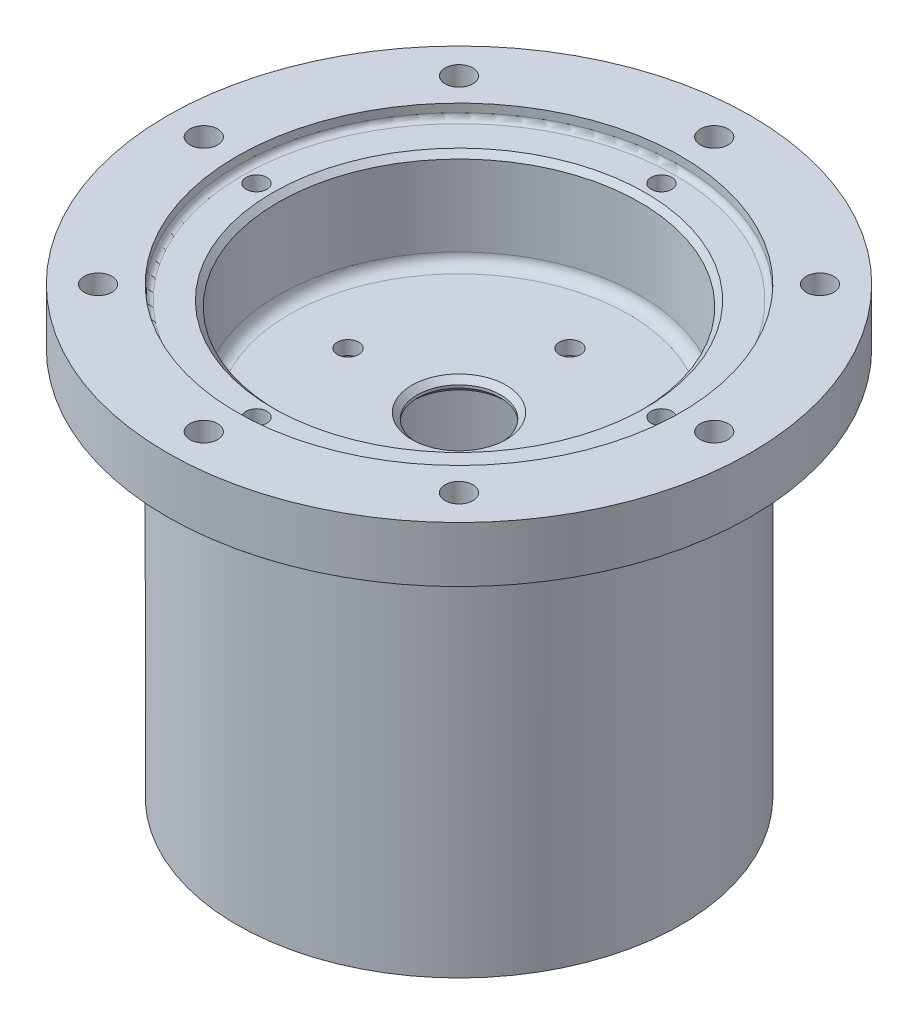
ISO-10303-21;
HEADER;
FILE_DESCRIPTION(('STEP AP214'),'2;1');
FILE_NAME('part.step','',(''),(''),'','','');
FILE_SCHEMA(('AUTOMOTIVE_DESIGN { 1 0 10303 214 1 1 1 1 }'));
ENDSEC;
DATA;
#1=APPLICATION_CONTEXT('core data for automotive mechanical design processes');
#2=APPLICATION_PROTOCOL_DEFINITION('international standard','automotive_design',2000,#1);
#3=PRODUCT_CONTEXT('',#1,'mechanical');
#4=PRODUCT('Part','Part','',(#3));
#5=PRODUCT_RELATED_PRODUCT_CATEGORY('part','',(#4));
#6=PRODUCT_DEFINITION_FORMATION('','',#4);
#7=PRODUCT_DEFINITION_CONTEXT('part definition',#1,'design');
#8=PRODUCT_DEFINITION('design','',#6,#7);
#9=PRODUCT_DEFINITION_SHAPE('','',#8);
#10=(LENGTH_UNIT() NAMED_UNIT(*) SI_UNIT(.MILLI.,.METRE.));
#11=(NAMED_UNIT(*) PLANE_ANGLE_UNIT() SI_UNIT($,.RADIAN.));
#12=(NAMED_UNIT(*) SI_UNIT($,.STERADIAN.) SOLID_ANGLE_UNIT());
#13=UNCERTAINTY_MEASURE_WITH_UNIT(LENGTH_MEASURE(1.E-05),#10,'distance_accuracy_value','');
#14=(GEOMETRIC_REPRESENTATION_CONTEXT(3) GLOBAL_UNCERTAINTY_ASSIGNED_CONTEXT((#13)) GLOBAL_UNIT_ASSIGNED_CONTEXT((#10,
#11,#12)) REPRESENTATION_CONTEXT('',''));
#15=CARTESIAN_POINT('',(0.,0.,0.));
#16=DIRECTION('',(0.,0.,1.));
#17=DIRECTION('',(1.,0.,0.));
#18=AXIS2_PLACEMENT_3D('',#15,#16,#17);
#19=CARTESIAN_POINT('',(-66.802,50.8,0.));
#20=DIRECTION('',(0.,1.,0.));
#21=DIRECTION('',(-1.,0.,0.));
#22=AXIS2_PLACEMENT_3D('',#19,#20,#21);
#23=PLANE('',#22);
#24=CARTESIAN_POINT('',(0.,50.8,-58.42));
#25=DIRECTION('',(0.,1.,0.));
#26=DIRECTION('',(0.,0.,1.));
#27=AXIS2_PLACEMENT_3D('',#24,#25,#26);
#28=CIRCLE('',#27,3.17499999999999);
#29=CARTESIAN_POINT('',(0.,50.8,-55.245));
#30=VERTEX_POINT('',#29);
#31=EDGE_CURVE('E563',#30,#30,#28,.T.);
#32=ORIENTED_EDGE('',*,*,#31,.F.);
#33=EDGE_LOOP('',(#32));
#34=FACE_BOUND('',#33,.T.);
#35=CARTESIAN_POINT('',(41.3091781569196,50.8,-41.3091781569217));
#36=DIRECTION('',(0.,1.,0.));
#37=DIRECTION('',(0.,0.,1.));
#38=AXIS2_PLACEMENT_3D('',#35,#36,#37);
#39=CIRCLE('',#38,3.17499999999999);
#40=CARTESIAN_POINT('',(41.3091781569196,50.8,-38.1341781569217));
#41=VERTEX_POINT('',#40);
#42=EDGE_CURVE('E565',#41,#41,#39,.T.);
#43=ORIENTED_EDGE('',*,*,#42,.F.);
#44=EDGE_LOOP('',(#43));
#45=FACE_BOUND('',#44,.T.);
#46=CARTESIAN_POINT('',(58.4200000000051,50.8,-5.13611453474389E-12));
#47=DIRECTION('',(0.,1.,0.));
#48=DIRECTION('',(0.,0.,1.));
#49=AXIS2_PLACEMENT_3D('',#46,#47,#48);
#50=CIRCLE('',#49,3.17499999999999);
#51=CARTESIAN_POINT('',(58.4200000000051,50.8,3.17499999999485));
#52=VERTEX_POINT('',#51);
#53=EDGE_CURVE('E573',#52,#52,#50,.T.);
#54=ORIENTED_EDGE('',*,*,#53,.F.);
#55=EDGE_LOOP('',(#54));
#56=FACE_BOUND('',#55,.T.);
#57=CARTESIAN_POINT('',(41.3091781569269,50.8,41.3091781569145));
#58=DIRECTION('',(0.,1.,0.));
#59=DIRECTION('',(0.,0.,1.));
#60=AXIS2_PLACEMENT_3D('',#57,#58,#59);
#61=CIRCLE('',#60,3.17499999999999);
#62=CARTESIAN_POINT('',(41.3091781569269,50.8,44.4841781569145));
#63=VERTEX_POINT('',#62);
#64=EDGE_CURVE('E579',#63,#63,#61,.T.);
#65=ORIENTED_EDGE('',*,*,#64,.F.);
#66=EDGE_LOOP('',(#65));
#67=FACE_BOUND('',#66,.T.);
#68=CARTESIAN_POINT('',(1.02566760551386E-11,50.8,58.42));
#69=DIRECTION('',(0.,1.,0.));
#70=DIRECTION('',(0.,0.,1.));
#71=AXIS2_PLACEMENT_3D('',#68,#69,#70);
#72=CIRCLE('',#71,3.17499999999999);
#73=CARTESIAN_POINT('',(1.02566760551386E-11,50.8,61.595));
#74=VERTEX_POINT('',#73);
#75=EDGE_CURVE('E585',#74,#74,#72,.T.);
#76=ORIENTED_EDGE('',*,*,#75,.F.);
#77=EDGE_LOOP('',(#76));
#78=FACE_BOUND('',#77,.T.);
#79=CARTESIAN_POINT('',(-41.3091781569093,50.8,41.3091781569217));
#80=DIRECTION('',(0.,1.,0.));
#81=DIRECTION('',(0.,0.,1.));
#82=AXIS2_PLACEMENT_3D('',#79,#80,#81);
#83=CIRCLE('',#82,3.17499999999999);
#84=CARTESIAN_POINT('',(-41.3091781569093,50.8,44.4841781569217));
#85=VERTEX_POINT('',#84);
#86=EDGE_CURVE('E591',#85,#85,#83,.T.);
#87=ORIENTED_EDGE('',*,*,#86,.F.);
#88=EDGE_LOOP('',(#87));
#89=FACE_BOUND('',#88,.T.);
#90=CARTESIAN_POINT('',(-58.4199999999949,50.8,5.14326892134451E-12));
#91=DIRECTION('',(0.,1.,0.));
#92=DIRECTION('',(0.,0.,1.));
#93=AXIS2_PLACEMENT_3D('',#90,#91,#92);
#94=CIRCLE('',#93,3.17499999999999);
#95=CARTESIAN_POINT('',(-58.4199999999949,50.8,3.17500000000513));
#96=VERTEX_POINT('',#95);
#97=EDGE_CURVE('E597',#96,#96,#94,.T.);
#98=ORIENTED_EDGE('',*,*,#97,.F.);
#99=EDGE_LOOP('',(#98));
#100=FACE_BOUND('',#99,.T.);
#101=CARTESIAN_POINT('',(-41.3091781569166,50.8,-41.3091781569145));
#102=DIRECTION('',(0.,1.,0.));
#103=DIRECTION('',(0.,0.,1.));
#104=AXIS2_PLACEMENT_3D('',#101,#102,#103);
#105=CIRCLE('',#104,3.17499999999999);
#106=CARTESIAN_POINT('',(-41.3091781569166,50.8,-38.1341781569145));
#107=VERTEX_POINT('',#106);
#108=EDGE_CURVE('E603',#107,#107,#105,.T.);
#109=ORIENTED_EDGE('',*,*,#108,.F.);
#110=EDGE_LOOP('',(#109));
#111=FACE_BOUND('',#110,.T.);
#112=CARTESIAN_POINT('',(0.,50.8,0.));
#113=DIRECTION('',(0.,1.,0.));
#114=DIRECTION('',(-1.,0.,0.));
#115=AXIS2_PLACEMENT_3D('',#112,#113,#114);
#116=CIRCLE('',#115,66.802);
#117=CARTESIAN_POINT('',(-66.802,50.8,0.));
#118=VERTEX_POINT('',#117);
#119=EDGE_CURVE('E109',#118,#118,#116,.T.);
#120=ORIENTED_EDGE('',*,*,#119,.T.);
#121=EDGE_LOOP('',(#120));
#122=FACE_BOUND('',#121,.T.);
#123=CARTESIAN_POINT('',(0.,50.8,0.));
#124=DIRECTION('',(0.,1.,0.));
#125=DIRECTION('',(-1.,0.,0.));
#126=AXIS2_PLACEMENT_3D('',#123,#124,#125);
#127=CIRCLE('',#126,50.8);
#128=CARTESIAN_POINT('',(-50.8,50.8,0.));
#129=VERTEX_POINT('',#128);
#130=EDGE_CURVE('E121',#129,#129,#127,.T.);
#131=ORIENTED_EDGE('',*,*,#130,.F.);
#132=EDGE_LOOP('',(#131));
#133=FACE_BOUND('',#132,.T.);
#134=ADVANCED_FACE('F33',(#34,#45,#56,#67,#78,#89,#100,#111,#122,#133),#23,.T.);
#135=CARTESIAN_POINT('',(0.,50.8,0.));
#136=DIRECTION('',(0.,1.,0.));
#137=DIRECTION('',(-1.,0.,0.));
#138=AXIS2_PLACEMENT_3D('',#135,#136,#137);
#139=CYLINDRICAL_SURFACE('',#138,50.8);
#140=CARTESIAN_POINT('',(0.,48.895,0.));
#141=DIRECTION('',(0.,1.,0.));
#142=DIRECTION('',(-1.,0.,0.));
#143=AXIS2_PLACEMENT_3D('',#140,#141,#142);
#144=CIRCLE('',#143,50.8);
#145=CARTESIAN_POINT('',(-50.8,48.895,0.));
#146=VERTEX_POINT('',#145);
#147=EDGE_CURVE('E149',#146,#146,#144,.F.);
#148=ORIENTED_EDGE('',*,*,#147,.T.);
#149=EDGE_LOOP('',(#148));
#150=FACE_BOUND('',#149,.T.);
#151=ORIENTED_EDGE('',*,*,#130,.T.);
#152=EDGE_LOOP('',(#151));
#153=FACE_BOUND('',#152,.T.);
#154=ADVANCED_FACE('F184',(#150,#153),#139,.F.);
#155=CARTESIAN_POINT('',(-50.8,47.625,0.));
#156=DIRECTION('',(0.,1.,0.));
#157=DIRECTION('',(-1.,0.,0.));
#158=AXIS2_PLACEMENT_3D('',#155,#156,#157);
#159=PLANE('',#158);
#160=CARTESIAN_POINT('',(0.,47.625,0.));
#161=DIRECTION('',(0.,1.,0.));
#162=DIRECTION('',(-1.,0.,0.));
#163=AXIS2_PLACEMENT_3D('',#160,#161,#162);
#164=CIRCLE('',#163,42.672);
#165=CARTESIAN_POINT('',(-42.672,47.625,0.));
#166=VERTEX_POINT('',#165);
#167=EDGE_CURVE('E11',#166,#166,#164,.F.);
#168=ORIENTED_EDGE('',*,*,#167,.T.);
#169=EDGE_LOOP('',(#168));
#170=FACE_BOUND('',#169,.T.);
#171=CARTESIAN_POINT('',(0.,47.625,0.));
#172=DIRECTION('',(0.,1.,0.));
#173=DIRECTION('',(-1.,0.,0.));
#174=AXIS2_PLACEMENT_3D('',#171,#172,#173);
#175=CIRCLE('',#174,49.53);
#176=CARTESIAN_POINT('',(-49.53,47.625,0.));
#177=VERTEX_POINT('',#176);
#178=EDGE_CURVE('E146',#177,#177,#175,.T.);
#179=ORIENTED_EDGE('',*,*,#178,.T.);
#180=EDGE_LOOP('',(#179));
#181=FACE_BOUND('',#180,.T.);
#182=CARTESIAN_POINT('',(0.,47.625,-46.355));
#183=DIRECTION('',(0.,1.,0.));
#184=DIRECTION('',(0.,0.,1.));
#185=AXIS2_PLACEMENT_3D('',#182,#183,#184);
#186=CIRCLE('',#185,2.38124999999999);
#187=CARTESIAN_POINT('',(0.,47.625,-43.97375));
#188=VERTEX_POINT('',#187);
#189=EDGE_CURVE('E65',#188,#188,#186,.T.);
#190=ORIENTED_EDGE('',*,*,#189,.F.);
#191=EDGE_LOOP('',(#190));
#192=FACE_BOUND('',#191,.T.);
#193=CARTESIAN_POINT('',(46.355,47.625,0.));
#194=DIRECTION('',(0.,1.,0.));
#195=DIRECTION('',(0.,0.,1.));
#196=AXIS2_PLACEMENT_3D('',#193,#194,#195);
#197=CIRCLE('',#196,2.38124999999999);
#198=CARTESIAN_POINT('',(46.355,47.625,2.38124999999999));
#199=VERTEX_POINT('',#198);
#200=EDGE_CURVE('E64',#199,#199,#197,.T.);
#201=ORIENTED_EDGE('',*,*,#200,.F.);
#202=EDGE_LOOP('',(#201));
#203=FACE_BOUND('',#202,.T.);
#204=CARTESIAN_POINT('',(0.,47.625,46.355));
#205=DIRECTION('',(0.,1.,0.));
#206=DIRECTION('',(0.,0.,1.));
#207=AXIS2_PLACEMENT_3D('',#204,#205,#206);
#208=CIRCLE('',#207,2.38124999999999);
#209=CARTESIAN_POINT('',(0.,47.625,48.73625));
#210=VERTEX_POINT('',#209);
#211=EDGE_CURVE('E77',#210,#210,#208,.T.);
#212=ORIENTED_EDGE('',*,*,#211,.F.);
#213=EDGE_LOOP('',(#212));
#214=FACE_BOUND('',#213,.T.);
#215=CARTESIAN_POINT('',(-46.355,47.625,0.));
#216=DIRECTION('',(0.,1.,0.));
#217=DIRECTION('',(0.,0.,1.));
#218=AXIS2_PLACEMENT_3D('',#215,#216,#217);
#219=CIRCLE('',#218,2.38124999999999);
#220=CARTESIAN_POINT('',(-46.355,47.625,2.38124999999999));
#221=VERTEX_POINT('',#220);
#222=EDGE_CURVE('E83',#221,#221,#219,.T.);
#223=ORIENTED_EDGE('',*,*,#222,.F.);
#224=EDGE_LOOP('',(#223));
#225=FACE_BOUND('',#224,.T.);
#226=ADVANCED_FACE('F190',(#170,#181,#192,#203,#214,#225),#159,.T.);
#227=CARTESIAN_POINT('',(0.,50.8,0.));
#228=DIRECTION('',(0.,1.,0.));
#229=DIRECTION('',(-1.,0.,0.));
#230=AXIS2_PLACEMENT_3D('',#227,#228,#229);
#231=CYLINDRICAL_SURFACE('',#230,41.402);
#232=CARTESIAN_POINT('',(0.,46.355,0.));
#233=DIRECTION('',(0.,1.,0.));
#234=DIRECTION('',(-1.,0.,0.));
#235=AXIS2_PLACEMENT_3D('',#232,#233,#234);
#236=CIRCLE('',#235,41.402);
#237=CARTESIAN_POINT('',(-41.402,46.355,0.));
#238=VERTEX_POINT('',#237);
#239=EDGE_CURVE('E41',#238,#238,#236,.T.);
#240=ORIENTED_EDGE('',*,*,#239,.T.);
#241=EDGE_LOOP('',(#240));
#242=FACE_BOUND('',#241,.T.);
#243=CARTESIAN_POINT('',(0.,27.94,0.));
#244=DIRECTION('',(0.,1.,0.));
#245=DIRECTION('',(-1.,0.,0.));
#246=AXIS2_PLACEMENT_3D('',#243,#244,#245);
#247=CIRCLE('',#246,41.402);
#248=CARTESIAN_POINT('',(-41.402,27.94,0.));
#249=VERTEX_POINT('',#248);
#250=EDGE_CURVE('E137',#249,#249,#247,.F.);
#251=ORIENTED_EDGE('',*,*,#250,.T.);
#252=EDGE_LOOP('',(#251));
#253=FACE_BOUND('',#252,.T.);
#254=ADVANCED_FACE('F166',(#242,#253),#231,.F.);
#255=CARTESIAN_POINT('',(-9.525,25.4,0.));
#256=DIRECTION('',(0.,1.,0.));
#257=DIRECTION('',(-1.,0.,0.));
#258=AXIS2_PLACEMENT_3D('',#255,#256,#257);
#259=PLANE('',#258);
#260=CARTESIAN_POINT('',(0.,25.4,0.));
#261=DIRECTION('',(0.,1.,0.));
#262=DIRECTION('',(-1.,0.,0.));
#263=AXIS2_PLACEMENT_3D('',#260,#261,#262);
#264=CIRCLE('',#263,10.795);
#265=CARTESIAN_POINT('',(-10.795,25.4,0.));
#266=VERTEX_POINT('',#265);
#267=EDGE_CURVE('E161',#266,#266,#264,.F.);
#268=ORIENTED_EDGE('',*,*,#267,.T.);
#269=EDGE_LOOP('',(#268));
#270=FACE_BOUND('',#269,.T.);
#271=CARTESIAN_POINT('',(0.,25.4,0.));
#272=DIRECTION('',(0.,1.,0.));
#273=DIRECTION('',(-1.,0.,0.));
#274=AXIS2_PLACEMENT_3D('',#271,#272,#273);
#275=CIRCLE('',#274,38.862);
#276=CARTESIAN_POINT('',(-38.862,25.4,0.));
#277=VERTEX_POINT('',#276);
#278=EDGE_CURVE('E134',#277,#277,#275,.T.);
#279=ORIENTED_EDGE('',*,*,#278,.T.);
#280=EDGE_LOOP('',(#279));
#281=FACE_BOUND('',#280,.T.);
#282=CARTESIAN_POINT('',(0.,25.4,-25.4));
#283=DIRECTION('',(0.,1.,0.));
#284=DIRECTION('',(0.,0.,1.));
#285=AXIS2_PLACEMENT_3D('',#282,#283,#284);
#286=CIRCLE('',#285,2.45744999999999);
#287=CARTESIAN_POINT('',(0.,25.4,-22.94255));
#288=VERTEX_POINT('',#287);
#289=EDGE_CURVE('E89',#288,#288,#286,.T.);
#290=ORIENTED_EDGE('',*,*,#289,.F.);
#291=EDGE_LOOP('',(#290));
#292=FACE_BOUND('',#291,.T.);
#293=CARTESIAN_POINT('',(25.4,25.4,0.));
#294=DIRECTION('',(0.,1.,0.));
#295=DIRECTION('',(0.,0.,1.));
#296=AXIS2_PLACEMENT_3D('',#293,#294,#295);
#297=CIRCLE('',#296,2.45744999999999);
#298=CARTESIAN_POINT('',(25.4,25.4,2.45744999999999));
#299=VERTEX_POINT('',#298);
#300=EDGE_CURVE('E93',#299,#299,#297,.T.);
#301=ORIENTED_EDGE('',*,*,#300,.F.);
#302=EDGE_LOOP('',(#301));
#303=FACE_BOUND('',#302,.T.);
#304=CARTESIAN_POINT('',(0.,25.4,25.4));
#305=DIRECTION('',(0.,1.,0.));
#306=DIRECTION('',(0.,0.,1.));
#307=AXIS2_PLACEMENT_3D('',#304,#305,#306);
#308=CIRCLE('',#307,2.45744999999999);
#309=CARTESIAN_POINT('',(0.,25.4,27.85745));
#310=VERTEX_POINT('',#309);
#311=EDGE_CURVE('E97',#310,#310,#308,.T.);
#312=ORIENTED_EDGE('',*,*,#311,.F.);
#313=EDGE_LOOP('',(#312));
#314=FACE_BOUND('',#313,.T.);
#315=CARTESIAN_POINT('',(-25.4,25.4,0.));
#316=DIRECTION('',(0.,1.,0.));
#317=DIRECTION('',(0.,0.,1.));
#318=AXIS2_PLACEMENT_3D('',#315,#316,#317);
#319=CIRCLE('',#318,2.45744999999999);
#320=CARTESIAN_POINT('',(-25.4,25.4,2.45744999999999));
#321=VERTEX_POINT('',#320);
#322=EDGE_CURVE('E103',#321,#321,#319,.T.);
#323=ORIENTED_EDGE('',*,*,#322,.F.);
#324=EDGE_LOOP('',(#323));
#325=FACE_BOUND('',#324,.T.);
#326=ADVANCED_FACE('F245',(#270,#281,#292,#303,#314,#325),#259,.T.);
#327=CARTESIAN_POINT('',(0.,50.8,0.));
#328=DIRECTION('',(0.,1.,0.));
#329=DIRECTION('',(-1.,0.,0.));
#330=AXIS2_PLACEMENT_3D('',#327,#328,#329);
#331=CYLINDRICAL_SURFACE('',#330,9.52499999999999);
#332=CARTESIAN_POINT('',(0.,23.495,0.));
#333=DIRECTION('',(0.,-1.,0.));
#334=DIRECTION('',(1.,0.,0.));
#335=AXIS2_PLACEMENT_3D('',#332,#333,#334);
#336=CIRCLE('',#335,9.52499999999999);
#337=CARTESIAN_POINT('',(9.52499999999998,23.495,0.));
#338=VERTEX_POINT('',#337);
#339=EDGE_CURVE('E158',#338,#338,#336,.T.);
#340=ORIENTED_EDGE('',*,*,#339,.T.);
#341=EDGE_LOOP('',(#340));
#342=FACE_BOUND('',#341,.T.);
#343=CARTESIAN_POINT('',(0.,24.13,0.));
#344=DIRECTION('',(0.,1.,0.));
#345=DIRECTION('',(-1.,0.,0.));
#346=AXIS2_PLACEMENT_3D('',#343,#344,#345);
#347=CIRCLE('',#346,9.52499999999999);
#348=CARTESIAN_POINT('',(-9.525,24.13,0.));
#349=VERTEX_POINT('',#348);
#350=EDGE_CURVE('E155',#349,#349,#347,.T.);
#351=ORIENTED_EDGE('',*,*,#350,.T.);
#352=EDGE_LOOP('',(#351));
#353=FACE_BOUND('',#352,.T.);
#354=ADVANCED_FACE('F225',(#342,#353),#331,.F.);
#355=CARTESIAN_POINT('',(-41.402,22.225,0.));
#356=DIRECTION('',(0.,-1.,0.));
#357=DIRECTION('',(1.,0.,0.));
#358=AXIS2_PLACEMENT_3D('',#355,#356,#357);
#359=PLANE('',#358);
#360=CARTESIAN_POINT('',(0.,22.225,0.));
#361=DIRECTION('',(0.,-1.,0.));
#362=DIRECTION('',(1.,0.,0.));
#363=AXIS2_PLACEMENT_3D('',#360,#361,#362);
#364=CIRCLE('',#363,10.795);
#365=CARTESIAN_POINT('',(10.795,22.225,0.));
#366=VERTEX_POINT('',#365);
#367=EDGE_CURVE('E152',#366,#366,#364,.F.);
#368=ORIENTED_EDGE('',*,*,#367,.T.);
#369=EDGE_LOOP('',(#368));
#370=FACE_BOUND('',#369,.T.);
#371=CARTESIAN_POINT('',(0.,22.225,0.));
#372=DIRECTION('',(0.,-1.,0.));
#373=DIRECTION('',(1.,0.,0.));
#374=AXIS2_PLACEMENT_3D('',#371,#372,#373);
#375=CIRCLE('',#374,38.862);
#376=CARTESIAN_POINT('',(38.862,22.225,0.));
#377=VERTEX_POINT('',#376);
#378=EDGE_CURVE('E143',#377,#377,#375,.T.);
#379=ORIENTED_EDGE('',*,*,#378,.T.);
#380=EDGE_LOOP('',(#379));
#381=FACE_BOUND('',#380,.T.);
#382=CARTESIAN_POINT('',(0.,22.225,-25.4));
#383=DIRECTION('',(0.,-1.,0.));
#384=DIRECTION('',(1.,0.,0.));
#385=AXIS2_PLACEMENT_3D('',#382,#383,#384);
#386=CIRCLE('',#385,2.45744999999999);
#387=CARTESIAN_POINT('',(2.45744999999998,22.225,-25.4));
#388=VERTEX_POINT('',#387);
#389=EDGE_CURVE('E92',#388,#388,#386,.T.);
#390=ORIENTED_EDGE('',*,*,#389,.F.);
#391=EDGE_LOOP('',(#390));
#392=FACE_BOUND('',#391,.T.);
#393=CARTESIAN_POINT('',(25.4,22.225,0.));
#394=DIRECTION('',(0.,-1.,0.));
#395=DIRECTION('',(1.,0.,0.));
#396=AXIS2_PLACEMENT_3D('',#393,#394,#395);
#397=CIRCLE('',#396,2.45744999999999);
#398=CARTESIAN_POINT('',(27.85745,22.225,0.));
#399=VERTEX_POINT('',#398);
#400=EDGE_CURVE('E96',#399,#399,#397,.T.);
#401=ORIENTED_EDGE('',*,*,#400,.F.);
#402=EDGE_LOOP('',(#401));
#403=FACE_BOUND('',#402,.T.);
#404=CARTESIAN_POINT('',(0.,22.225,25.4));
#405=DIRECTION('',(0.,-1.,0.));
#406=DIRECTION('',(1.,0.,0.));
#407=AXIS2_PLACEMENT_3D('',#404,#405,#406);
#408=CIRCLE('',#407,2.45744999999999);
#409=CARTESIAN_POINT('',(2.45744999999998,22.225,25.4));
#410=VERTEX_POINT('',#409);
#411=EDGE_CURVE('E100',#410,#410,#408,.T.);
#412=ORIENTED_EDGE('',*,*,#411,.F.);
#413=EDGE_LOOP('',(#412));
#414=FACE_BOUND('',#413,.T.);
#415=CARTESIAN_POINT('',(-25.4,22.225,0.));
#416=DIRECTION('',(0.,-1.,0.));
#417=DIRECTION('',(1.,0.,0.));
#418=AXIS2_PLACEMENT_3D('',#415,#416,#417);
#419=CIRCLE('',#418,2.45744999999999);
#420=CARTESIAN_POINT('',(-22.94255,22.225,0.));
#421=VERTEX_POINT('',#420);
#422=EDGE_CURVE('E106',#421,#421,#419,.T.);
#423=ORIENTED_EDGE('',*,*,#422,.F.);
#424=EDGE_LOOP('',(#423));
#425=FACE_BOUND('',#424,.T.);
#426=ADVANCED_FACE('F221',(#370,#381,#392,#403,#414,#425),#359,.T.);
#427=CARTESIAN_POINT('',(0.,50.8,0.));
#428=DIRECTION('',(0.,1.,0.));
#429=DIRECTION('',(-1.,0.,0.));
#430=AXIS2_PLACEMENT_3D('',#427,#428,#429);
#431=CYLINDRICAL_SURFACE('',#430,41.402);
#432=CARTESIAN_POINT('',(0.,19.685,0.));
#433=DIRECTION('',(0.,-1.,0.));
#434=DIRECTION('',(1.,0.,0.));
#435=AXIS2_PLACEMENT_3D('',#432,#433,#434);
#436=CIRCLE('',#435,41.402);
#437=CARTESIAN_POINT('',(41.402,19.685,0.));
#438=VERTEX_POINT('',#437);
#439=EDGE_CURVE('E140',#438,#438,#436,.F.);
#440=ORIENTED_EDGE('',*,*,#439,.T.);
#441=EDGE_LOOP('',(#440));
#442=FACE_BOUND('',#441,.T.);
#443=CARTESIAN_POINT('',(0.,-50.8,0.));
#444=DIRECTION('',(0.,1.,0.));
#445=DIRECTION('',(-1.,0.,0.));
#446=AXIS2_PLACEMENT_3D('',#443,#444,#445);
#447=CIRCLE('',#446,41.402);
#448=CARTESIAN_POINT('',(-41.402,-50.8,0.));
#449=VERTEX_POINT('',#448);
#450=EDGE_CURVE('E118',#449,#449,#447,.T.);
#451=ORIENTED_EDGE('',*,*,#450,.F.);
#452=EDGE_LOOP('',(#451));
#453=FACE_BOUND('',#452,.T.);
#454=ADVANCED_FACE('F224',(#442,#453),#431,.F.);
#455=CARTESIAN_POINT('',(-50.8,-50.8,0.));
#456=DIRECTION('',(0.,-1.,0.));
#457=DIRECTION('',(1.,0.,0.));
#458=AXIS2_PLACEMENT_3D('',#455,#456,#457);
#459=PLANE('',#458);
#460=ORIENTED_EDGE('',*,*,#450,.T.);
#461=EDGE_LOOP('',(#460));
#462=FACE_BOUND('',#461,.T.);
#463=CARTESIAN_POINT('',(0.,-50.8,0.));
#464=DIRECTION('',(0.,1.,0.));
#465=DIRECTION('',(-1.,0.,0.));
#466=AXIS2_PLACEMENT_3D('',#463,#464,#465);
#467=CIRCLE('',#466,50.8);
#468=CARTESIAN_POINT('',(-50.8,-50.8,0.));
#469=VERTEX_POINT('',#468);
#470=EDGE_CURVE('E115',#469,#469,#467,.T.);
#471=ORIENTED_EDGE('',*,*,#470,.F.);
#472=EDGE_LOOP('',(#471));
#473=FACE_BOUND('',#472,.T.);
#474=ADVANCED_FACE('F309',(#462,#473),#459,.T.);
#475=CARTESIAN_POINT('',(0.,50.8,0.));
#476=DIRECTION('',(0.,1.,0.));
#477=DIRECTION('',(-1.,0.,0.));
#478=AXIS2_PLACEMENT_3D('',#475,#476,#477);
#479=CYLINDRICAL_SURFACE('',#478,50.8);
#480=CARTESIAN_POINT('',(0.,35.56,0.));
#481=DIRECTION('',(0.,-1.,0.));
#482=DIRECTION('',(1.,0.,0.));
#483=AXIS2_PLACEMENT_3D('',#480,#481,#482);
#484=CIRCLE('',#483,50.8);
#485=CARTESIAN_POINT('',(50.8,35.56,0.));
#486=VERTEX_POINT('',#485);
#487=EDGE_CURVE('E131',#486,#486,#484,.T.);
#488=ORIENTED_EDGE('',*,*,#487,.T.);
#489=EDGE_LOOP('',(#488));
#490=FACE_BOUND('',#489,.T.);
#491=ORIENTED_EDGE('',*,*,#470,.T.);
#492=EDGE_LOOP('',(#491));
#493=FACE_BOUND('',#492,.T.);
#494=ADVANCED_FACE('F305',(#490,#493),#479,.T.);
#495=CARTESIAN_POINT('',(-66.802,38.1,0.));
#496=DIRECTION('',(0.,-1.,0.));
#497=DIRECTION('',(1.,0.,0.));
#498=AXIS2_PLACEMENT_3D('',#495,#496,#497);
#499=PLANE('',#498);
#500=CARTESIAN_POINT('',(0.,38.1,-58.42));
#501=DIRECTION('',(0.,1.,0.));
#502=DIRECTION('',(0.,0.,1.));
#503=AXIS2_PLACEMENT_3D('',#500,#501,#502);
#504=CIRCLE('',#503,3.175);
#505=CARTESIAN_POINT('',(0.,38.1,-55.245));
#506=VERTEX_POINT('',#505);
#507=EDGE_CURVE('E561',#506,#506,#504,.T.);
#508=ORIENTED_EDGE('',*,*,#507,.T.);
#509=EDGE_LOOP('',(#508));
#510=FACE_BOUND('',#509,.T.);
#511=CARTESIAN_POINT('',(41.3091781569196,38.1,-41.3091781569217));
#512=DIRECTION('',(0.,1.,0.));
#513=DIRECTION('',(0.,0.,1.));
#514=AXIS2_PLACEMENT_3D('',#511,#512,#513);
#515=CIRCLE('',#514,3.175);
#516=CARTESIAN_POINT('',(41.3091781569196,38.1,-38.1341781569217));
#517=VERTEX_POINT('',#516);
#518=EDGE_CURVE('E570',#517,#517,#515,.T.);
#519=ORIENTED_EDGE('',*,*,#518,.T.);
#520=EDGE_LOOP('',(#519));
#521=FACE_BOUND('',#520,.T.);
#522=CARTESIAN_POINT('',(58.4200000000051,38.1,-5.13611453474389E-12));
#523=DIRECTION('',(0.,1.,0.));
#524=DIRECTION('',(0.,0.,1.));
#525=AXIS2_PLACEMENT_3D('',#522,#523,#524);
#526=CIRCLE('',#525,3.175);
#527=CARTESIAN_POINT('',(58.4200000000051,38.1,3.17499999999486));
#528=VERTEX_POINT('',#527);
#529=EDGE_CURVE('E576',#528,#528,#526,.T.);
#530=ORIENTED_EDGE('',*,*,#529,.T.);
#531=EDGE_LOOP('',(#530));
#532=FACE_BOUND('',#531,.T.);
#533=CARTESIAN_POINT('',(41.3091781569269,38.1,41.3091781569145));
#534=DIRECTION('',(0.,1.,0.));
#535=DIRECTION('',(0.,0.,1.));
#536=AXIS2_PLACEMENT_3D('',#533,#534,#535);
#537=CIRCLE('',#536,3.175);
#538=CARTESIAN_POINT('',(41.3091781569269,38.1,44.4841781569145));
#539=VERTEX_POINT('',#538);
#540=EDGE_CURVE('E582',#539,#539,#537,.T.);
#541=ORIENTED_EDGE('',*,*,#540,.T.);
#542=EDGE_LOOP('',(#541));
#543=FACE_BOUND('',#542,.T.);
#544=CARTESIAN_POINT('',(1.02566760551386E-11,38.1,58.42));
#545=DIRECTION('',(0.,1.,0.));
#546=DIRECTION('',(0.,0.,1.));
#547=AXIS2_PLACEMENT_3D('',#544,#545,#546);
#548=CIRCLE('',#547,3.175);
#549=CARTESIAN_POINT('',(1.02566760551386E-11,38.1,61.595));
#550=VERTEX_POINT('',#549);
#551=EDGE_CURVE('E588',#550,#550,#548,.T.);
#552=ORIENTED_EDGE('',*,*,#551,.T.);
#553=EDGE_LOOP('',(#552));
#554=FACE_BOUND('',#553,.T.);
#555=CARTESIAN_POINT('',(-41.3091781569093,38.1,41.3091781569217));
#556=DIRECTION('',(0.,1.,0.));
#557=DIRECTION('',(0.,0.,1.));
#558=AXIS2_PLACEMENT_3D('',#555,#556,#557);
#559=CIRCLE('',#558,3.175);
#560=CARTESIAN_POINT('',(-41.3091781569093,38.1,44.4841781569217));
#561=VERTEX_POINT('',#560);
#562=EDGE_CURVE('E594',#561,#561,#559,.T.);
#563=ORIENTED_EDGE('',*,*,#562,.T.);
#564=EDGE_LOOP('',(#563));
#565=FACE_BOUND('',#564,.T.);
#566=CARTESIAN_POINT('',(-58.4199999999949,38.1,5.14326892134451E-12));
#567=DIRECTION('',(0.,1.,0.));
#568=DIRECTION('',(0.,0.,1.));
#569=AXIS2_PLACEMENT_3D('',#566,#567,#568);
#570=CIRCLE('',#569,3.175);
#571=CARTESIAN_POINT('',(-58.4199999999949,38.1,3.17500000000514));
#572=VERTEX_POINT('',#571);
#573=EDGE_CURVE('E600',#572,#572,#570,.T.);
#574=ORIENTED_EDGE('',*,*,#573,.T.);
#575=EDGE_LOOP('',(#574));
#576=FACE_BOUND('',#575,.T.);
#577=CARTESIAN_POINT('',(-41.3091781569166,38.1,-41.3091781569145));
#578=DIRECTION('',(0.,1.,0.));
#579=DIRECTION('',(0.,0.,1.));
#580=AXIS2_PLACEMENT_3D('',#577,#578,#579);
#581=CIRCLE('',#580,3.175);
#582=CARTESIAN_POINT('',(-41.3091781569166,38.1,-38.1341781569145));
#583=VERTEX_POINT('',#582);
#584=EDGE_CURVE('E71',#583,#583,#581,.T.);
#585=ORIENTED_EDGE('',*,*,#584,.T.);
#586=EDGE_LOOP('',(#585));
#587=FACE_BOUND('',#586,.T.);
#588=CARTESIAN_POINT('',(0.,38.1,0.));
#589=DIRECTION('',(0.,-1.,0.));
#590=DIRECTION('',(1.,0.,0.));
#591=AXIS2_PLACEMENT_3D('',#588,#589,#590);
#592=CIRCLE('',#591,53.34);
#593=CARTESIAN_POINT('',(53.34,38.1,0.));
#594=VERTEX_POINT('',#593);
#595=EDGE_CURVE('E124',#594,#594,#592,.F.);
#596=ORIENTED_EDGE('',*,*,#595,.T.);
#597=EDGE_LOOP('',(#596));
#598=FACE_BOUND('',#597,.T.);
#599=CARTESIAN_POINT('',(0.,38.1,0.));
#600=DIRECTION('',(0.,1.,0.));
#601=DIRECTION('',(-1.,0.,0.));
#602=AXIS2_PLACEMENT_3D('',#599,#600,#601);
#603=CIRCLE('',#602,66.802);
#604=CARTESIAN_POINT('',(-66.802,38.1,0.));
#605=VERTEX_POINT('',#604);
#606=EDGE_CURVE('E112',#605,#605,#603,.T.);
#607=ORIENTED_EDGE('',*,*,#606,.F.);
#608=EDGE_LOOP('',(#607));
#609=FACE_BOUND('',#608,.T.);
#610=ADVANCED_FACE('F301',(#510,#521,#532,#543,#554,#565,#576,#587,#598,#609),#499,.T.);
#611=CARTESIAN_POINT('',(0.,50.8,0.));
#612=DIRECTION('',(0.,1.,0.));
#613=DIRECTION('',(-1.,0.,0.));
#614=AXIS2_PLACEMENT_3D('',#611,#612,#613);
#615=CYLINDRICAL_SURFACE('',#614,66.802);
#616=ORIENTED_EDGE('',*,*,#606,.T.);
#617=EDGE_LOOP('',(#616));
#618=FACE_BOUND('',#617,.T.);
#619=ORIENTED_EDGE('',*,*,#119,.F.);
#620=EDGE_LOOP('',(#619));
#621=FACE_BOUND('',#620,.T.);
#622=ADVANCED_FACE('F241',(#618,#621),#615,.T.);
#623=CARTESIAN_POINT('',(-25.4,25.4,0.));
#624=DIRECTION('',(0.,1.,0.));
#625=DIRECTION('',(0.,0.,1.));
#626=AXIS2_PLACEMENT_3D('',#623,#624,#625);
#627=CYLINDRICAL_SURFACE('',#626,2.45744999999999);
#628=ORIENTED_EDGE('',*,*,#422,.T.);
#629=EDGE_LOOP('',(#628));
#630=FACE_BOUND('',#629,.T.);
#631=ORIENTED_EDGE('',*,*,#322,.T.);
#632=EDGE_LOOP('',(#631));
#633=FACE_BOUND('',#632,.T.);
#634=ADVANCED_FACE('F237',(#630,#633),#627,.F.);
#635=CARTESIAN_POINT('',(0.,25.4,25.4));
#636=DIRECTION('',(0.,1.,0.));
#637=DIRECTION('',(0.,0.,1.));
#638=AXIS2_PLACEMENT_3D('',#635,#636,#637);
#639=CYLINDRICAL_SURFACE('',#638,2.45744999999999);
#640=ORIENTED_EDGE('',*,*,#411,.T.);
#641=EDGE_LOOP('',(#640));
#642=FACE_BOUND('',#641,.T.);
#643=ORIENTED_EDGE('',*,*,#311,.T.);
#644=EDGE_LOOP('',(#643));
#645=FACE_BOUND('',#644,.T.);
#646=ADVANCED_FACE('F240',(#642,#645),#639,.F.);
#647=CARTESIAN_POINT('',(25.4,25.4,0.));
#648=DIRECTION('',(0.,1.,0.));
#649=DIRECTION('',(0.,0.,1.));
#650=AXIS2_PLACEMENT_3D('',#647,#648,#649);
#651=CYLINDRICAL_SURFACE('',#650,2.45744999999999);
#652=ORIENTED_EDGE('',*,*,#400,.T.);
#653=EDGE_LOOP('',(#652));
#654=FACE_BOUND('',#653,.T.);
#655=ORIENTED_EDGE('',*,*,#300,.T.);
#656=EDGE_LOOP('',(#655));
#657=FACE_BOUND('',#656,.T.);
#658=ADVANCED_FACE('F291',(#654,#657),#651,.F.);
#659=CARTESIAN_POINT('',(0.,25.4,-25.4));
#660=DIRECTION('',(0.,1.,0.));
#661=DIRECTION('',(0.,0.,1.));
#662=AXIS2_PLACEMENT_3D('',#659,#660,#661);
#663=CYLINDRICAL_SURFACE('',#662,2.45744999999999);
#664=ORIENTED_EDGE('',*,*,#389,.T.);
#665=EDGE_LOOP('',(#664));
#666=FACE_BOUND('',#665,.T.);
#667=ORIENTED_EDGE('',*,*,#289,.T.);
#668=EDGE_LOOP('',(#667));
#669=FACE_BOUND('',#668,.T.);
#670=ADVANCED_FACE('F284',(#666,#669),#663,.F.);
#671=CARTESIAN_POINT('',(-46.355,41.275,0.));
#672=DIRECTION('',(0.,1.,0.));
#673=DIRECTION('',(0.,0.,1.));
#674=AXIS2_PLACEMENT_3D('',#671,#672,#673);
#675=CONICAL_SURFACE('',#674,2.38124999999999,1.02974425867665);
#676=CARTESIAN_POINT('',(-46.355,39.8442006509406,0.));
#677=VERTEX_POINT('',#676);
#678=VERTEX_LOOP('',#677);
#679=FACE_BOUND('',#678,.T.);
#680=CARTESIAN_POINT('',(-46.355,41.275,0.));
#681=DIRECTION('',(0.,1.,0.));
#682=DIRECTION('',(0.,0.,1.));
#683=AXIS2_PLACEMENT_3D('',#680,#681,#682);
#684=CIRCLE('',#683,2.38124999999999);
#685=CARTESIAN_POINT('',(-46.355,41.275,2.38124999999999));
#686=VERTEX_POINT('',#685);
#687=EDGE_CURVE('E86',#686,#686,#684,.T.);
#688=ORIENTED_EDGE('',*,*,#687,.T.);
#689=EDGE_LOOP('',(#688));
#690=FACE_BOUND('',#689,.T.);
#691=ADVANCED_FACE('F275',(#679,#690),#675,.F.);
#692=CARTESIAN_POINT('',(-46.355,47.625,0.));
#693=DIRECTION('',(0.,1.,0.));
#694=DIRECTION('',(0.,0.,1.));
#695=AXIS2_PLACEMENT_3D('',#692,#693,#694);
#696=CYLINDRICAL_SURFACE('',#695,2.38124999999999);
#697=ORIENTED_EDGE('',*,*,#687,.F.);
#698=EDGE_LOOP('',(#697));
#699=FACE_BOUND('',#698,.T.);
#700=ORIENTED_EDGE('',*,*,#222,.T.);
#701=EDGE_LOOP('',(#700));
#702=FACE_BOUND('',#701,.T.);
#703=ADVANCED_FACE('F272',(#699,#702),#696,.F.);
#704=CARTESIAN_POINT('',(0.,41.275,46.355));
#705=DIRECTION('',(0.,1.,0.));
#706=DIRECTION('',(0.,0.,1.));
#707=AXIS2_PLACEMENT_3D('',#704,#705,#706);
#708=CONICAL_SURFACE('',#707,2.38124999999999,1.02974425867665);
#709=CARTESIAN_POINT('',(0.,39.8442006509406,46.355));
#710=VERTEX_POINT('',#709);
#711=VERTEX_LOOP('',#710);
#712=FACE_BOUND('',#711,.T.);
#713=CARTESIAN_POINT('',(0.,41.275,46.355));
#714=DIRECTION('',(0.,1.,0.));
#715=DIRECTION('',(0.,0.,1.));
#716=AXIS2_PLACEMENT_3D('',#713,#714,#715);
#717=CIRCLE('',#716,2.38124999999999);
#718=CARTESIAN_POINT('',(0.,41.275,48.73625));
#719=VERTEX_POINT('',#718);
#720=EDGE_CURVE('E80',#719,#719,#717,.T.);
#721=ORIENTED_EDGE('',*,*,#720,.T.);
#722=EDGE_LOOP('',(#721));
#723=FACE_BOUND('',#722,.T.);
#724=ADVANCED_FACE('F274',(#712,#723),#708,.F.);
#725=CARTESIAN_POINT('',(0.,47.625,46.355));
#726=DIRECTION('',(0.,1.,0.));
#727=DIRECTION('',(0.,0.,1.));
#728=AXIS2_PLACEMENT_3D('',#725,#726,#727);
#729=CYLINDRICAL_SURFACE('',#728,2.38124999999999);
#730=ORIENTED_EDGE('',*,*,#720,.F.);
#731=EDGE_LOOP('',(#730));
#732=FACE_BOUND('',#731,.T.);
#733=ORIENTED_EDGE('',*,*,#211,.T.);
#734=EDGE_LOOP('',(#733));
#735=FACE_BOUND('',#734,.T.);
#736=ADVANCED_FACE('F282',(#732,#735),#729,.F.);
#737=CARTESIAN_POINT('',(46.355,41.275,0.));
#738=DIRECTION('',(0.,1.,0.));
#739=DIRECTION('',(0.,0.,1.));
#740=AXIS2_PLACEMENT_3D('',#737,#738,#739);
#741=CONICAL_SURFACE('',#740,2.38124999999999,1.02974425867665);
#742=CARTESIAN_POINT('',(46.355,39.8442006509407,0.));
#743=VERTEX_POINT('',#742);
#744=VERTEX_LOOP('',#743);
#745=FACE_BOUND('',#744,.T.);
#746=CARTESIAN_POINT('',(46.355,41.275,0.));
#747=DIRECTION('',(0.,1.,0.));
#748=DIRECTION('',(0.,0.,1.));
#749=AXIS2_PLACEMENT_3D('',#746,#747,#748);
#750=CIRCLE('',#749,2.38124999999999);
#751=CARTESIAN_POINT('',(46.355,41.275,2.38124999999999));
#752=VERTEX_POINT('',#751);
#753=EDGE_CURVE('E68',#752,#752,#750,.T.);
#754=ORIENTED_EDGE('',*,*,#753,.T.);
#755=EDGE_LOOP('',(#754));
#756=FACE_BOUND('',#755,.T.);
#757=ADVANCED_FACE('F385',(#745,#756),#741,.F.);
#758=CARTESIAN_POINT('',(46.355,47.625,0.));
#759=DIRECTION('',(0.,1.,0.));
#760=DIRECTION('',(0.,0.,1.));
#761=AXIS2_PLACEMENT_3D('',#758,#759,#760);
#762=CYLINDRICAL_SURFACE('',#761,2.38124999999999);
#763=ORIENTED_EDGE('',*,*,#753,.F.);
#764=EDGE_LOOP('',(#763));
#765=FACE_BOUND('',#764,.T.);
#766=ORIENTED_EDGE('',*,*,#200,.T.);
#767=EDGE_LOOP('',(#766));
#768=FACE_BOUND('',#767,.T.);
#769=ADVANCED_FACE('F58',(#765,#768),#762,.F.);
#770=CARTESIAN_POINT('',(0.,41.275,-46.355));
#771=DIRECTION('',(0.,1.,0.));
#772=DIRECTION('',(0.,0.,1.));
#773=AXIS2_PLACEMENT_3D('',#770,#771,#772);
#774=CONICAL_SURFACE('',#773,2.38124999999999,1.02974425867665);
#775=CARTESIAN_POINT('',(0.,39.8442006509406,-46.355));
#776=VERTEX_POINT('',#775);
#777=VERTEX_LOOP('',#776);
#778=FACE_BOUND('',#777,.T.);
#779=CARTESIAN_POINT('',(0.,41.275,-46.355));
#780=DIRECTION('',(0.,1.,0.));
#781=DIRECTION('',(0.,0.,1.));
#782=AXIS2_PLACEMENT_3D('',#779,#780,#781);
#783=CIRCLE('',#782,2.38124999999999);
#784=CARTESIAN_POINT('',(0.,41.275,-43.97375));
#785=VERTEX_POINT('',#784);
#786=EDGE_CURVE('E62',#785,#785,#783,.T.);
#787=ORIENTED_EDGE('',*,*,#786,.T.);
#788=EDGE_LOOP('',(#787));
#789=FACE_BOUND('',#788,.T.);
#790=ADVANCED_FACE('F54',(#778,#789),#774,.F.);
#791=CARTESIAN_POINT('',(0.,47.625,-46.355));
#792=DIRECTION('',(0.,1.,0.));
#793=DIRECTION('',(0.,0.,1.));
#794=AXIS2_PLACEMENT_3D('',#791,#792,#793);
#795=CYLINDRICAL_SURFACE('',#794,2.38124999999999);
#796=ORIENTED_EDGE('',*,*,#786,.F.);
#797=EDGE_LOOP('',(#796));
#798=FACE_BOUND('',#797,.T.);
#799=ORIENTED_EDGE('',*,*,#189,.T.);
#800=EDGE_LOOP('',(#799));
#801=FACE_BOUND('',#800,.T.);
#802=ADVANCED_FACE('F57',(#798,#801),#795,.F.);
#803=CARTESIAN_POINT('',(0.,35.56,0.));
#804=DIRECTION('',(0.,-1.,0.));
#805=DIRECTION('',(1.,0.,0.));
#806=AXIS2_PLACEMENT_3D('',#803,#804,#805);
#807=TOROIDAL_SURFACE('',#806,53.34,2.54);
#808=ORIENTED_EDGE('',*,*,#487,.F.);
#809=EDGE_LOOP('',(#808));
#810=FACE_BOUND('',#809,.T.);
#811=ORIENTED_EDGE('',*,*,#595,.F.);
#812=EDGE_LOOP('',(#811));
#813=FACE_BOUND('',#812,.T.);
#814=ADVANCED_FACE('F197',(#810,#813),#807,.F.);
#815=CARTESIAN_POINT('',(0.,27.94,0.));
#816=DIRECTION('',(0.,1.,0.));
#817=DIRECTION('',(-1.,0.,0.));
#818=AXIS2_PLACEMENT_3D('',#815,#816,#817);
#819=TOROIDAL_SURFACE('',#818,38.862,2.54);
#820=ORIENTED_EDGE('',*,*,#250,.F.);
#821=EDGE_LOOP('',(#820));
#822=FACE_BOUND('',#821,.T.);
#823=ORIENTED_EDGE('',*,*,#278,.F.);
#824=EDGE_LOOP('',(#823));
#825=FACE_BOUND('',#824,.T.);
#826=ADVANCED_FACE('F200',(#822,#825),#819,.F.);
#827=CARTESIAN_POINT('',(0.,19.685,0.));
#828=DIRECTION('',(0.,-1.,0.));
#829=DIRECTION('',(1.,0.,0.));
#830=AXIS2_PLACEMENT_3D('',#827,#828,#829);
#831=TOROIDAL_SURFACE('',#830,38.862,2.54);
#832=ORIENTED_EDGE('',*,*,#378,.F.);
#833=EDGE_LOOP('',(#832));
#834=FACE_BOUND('',#833,.T.);
#835=ORIENTED_EDGE('',*,*,#439,.F.);
#836=EDGE_LOOP('',(#835));
#837=FACE_BOUND('',#836,.T.);
#838=ADVANCED_FACE('F204',(#834,#837),#831,.F.);
#839=CARTESIAN_POINT('',(0.,48.895,0.));
#840=DIRECTION('',(0.,1.,0.));
#841=DIRECTION('',(-1.,0.,0.));
#842=AXIS2_PLACEMENT_3D('',#839,#840,#841);
#843=TOROIDAL_SURFACE('',#842,49.53,1.27);
#844=ORIENTED_EDGE('',*,*,#147,.F.);
#845=EDGE_LOOP('',(#844));
#846=FACE_BOUND('',#845,.T.);
#847=ORIENTED_EDGE('',*,*,#178,.F.);
#848=EDGE_LOOP('',(#847));
#849=FACE_BOUND('',#848,.T.);
#850=ADVANCED_FACE('F208',(#846,#849),#843,.F.);
#851=CARTESIAN_POINT('',(0.,22.225,0.));
#852=DIRECTION('',(0.,-1.,0.));
#853=DIRECTION('',(1.,0.,0.));
#854=AXIS2_PLACEMENT_3D('',#851,#852,#853);
#855=CONICAL_SURFACE('',#854,10.795,0.785398163397453);
#856=ORIENTED_EDGE('',*,*,#339,.F.);
#857=EDGE_LOOP('',(#856));
#858=FACE_BOUND('',#857,.T.);
#859=ORIENTED_EDGE('',*,*,#367,.F.);
#860=EDGE_LOOP('',(#859));
#861=FACE_BOUND('',#860,.T.);
#862=ADVANCED_FACE('F180',(#858,#861),#855,.F.);
#863=CARTESIAN_POINT('',(0.,24.13,0.));
#864=DIRECTION('',(0.,1.,0.));
#865=DIRECTION('',(-1.,0.,0.));
#866=AXIS2_PLACEMENT_3D('',#863,#864,#865);
#867=CONICAL_SURFACE('',#866,9.52499999999999,0.785398163397452);
#868=ORIENTED_EDGE('',*,*,#267,.F.);
#869=EDGE_LOOP('',(#868));
#870=FACE_BOUND('',#869,.T.);
#871=ORIENTED_EDGE('',*,*,#350,.F.);
#872=EDGE_LOOP('',(#871));
#873=FACE_BOUND('',#872,.T.);
#874=ADVANCED_FACE('F171',(#870,#873),#867,.F.);
#875=CARTESIAN_POINT('',(0.,46.355,0.));
#876=DIRECTION('',(0.,1.,0.));
#877=DIRECTION('',(-1.,0.,0.));
#878=AXIS2_PLACEMENT_3D('',#875,#876,#877);
#879=CONICAL_SURFACE('',#878,41.402,0.785398163397446);
#880=ORIENTED_EDGE('',*,*,#167,.F.);
#881=EDGE_LOOP('',(#880));
#882=FACE_BOUND('',#881,.T.);
#883=ORIENTED_EDGE('',*,*,#239,.F.);
#884=EDGE_LOOP('',(#883));
#885=FACE_BOUND('',#884,.T.);
#886=ADVANCED_FACE('F35',(#882,#885),#879,.F.);
#887=CARTESIAN_POINT('',(-41.3091781569166,50.8,-41.3091781569145));
#888=DIRECTION('',(0.,1.,0.));
#889=DIRECTION('',(0.,0.,1.));
#890=AXIS2_PLACEMENT_3D('',#887,#888,#889);
#891=CYLINDRICAL_SURFACE('',#890,3.17499999999999);
#892=ORIENTED_EDGE('',*,*,#584,.F.);
#893=EDGE_LOOP('',(#892));
#894=FACE_BOUND('',#893,.T.);
#895=ORIENTED_EDGE('',*,*,#108,.T.);
#896=EDGE_LOOP('',(#895));
#897=FACE_BOUND('',#896,.T.);
#898=ADVANCED_FACE('F170',(#894,#897),#891,.F.);
#899=CARTESIAN_POINT('',(-58.4199999999949,50.8,5.14326892134451E-12));
#900=DIRECTION('',(0.,1.,0.));
#901=DIRECTION('',(0.,0.,1.));
#902=AXIS2_PLACEMENT_3D('',#899,#900,#901);
#903=CYLINDRICAL_SURFACE('',#902,3.17499999999999);
#904=ORIENTED_EDGE('',*,*,#573,.F.);
#905=EDGE_LOOP('',(#904));
#906=FACE_BOUND('',#905,.T.);
#907=ORIENTED_EDGE('',*,*,#97,.T.);
#908=EDGE_LOOP('',(#907));
#909=FACE_BOUND('',#908,.T.);
#910=ADVANCED_FACE('F177',(#906,#909),#903,.F.);
#911=CARTESIAN_POINT('',(-41.3091781569093,50.8,41.3091781569217));
#912=DIRECTION('',(0.,1.,0.));
#913=DIRECTION('',(0.,0.,1.));
#914=AXIS2_PLACEMENT_3D('',#911,#912,#913);
#915=CYLINDRICAL_SURFACE('',#914,3.17499999999999);
#916=ORIENTED_EDGE('',*,*,#562,.F.);
#917=EDGE_LOOP('',(#916));
#918=FACE_BOUND('',#917,.T.);
#919=ORIENTED_EDGE('',*,*,#86,.T.);
#920=EDGE_LOOP('',(#919));
#921=FACE_BOUND('',#920,.T.);
#922=ADVANCED_FACE('F494',(#918,#921),#915,.F.);
#923=CARTESIAN_POINT('',(1.02566760551386E-11,50.8,58.42));
#924=DIRECTION('',(0.,1.,0.));
#925=DIRECTION('',(0.,0.,1.));
#926=AXIS2_PLACEMENT_3D('',#923,#924,#925);
#927=CYLINDRICAL_SURFACE('',#926,3.17499999999999);
#928=ORIENTED_EDGE('',*,*,#551,.F.);
#929=EDGE_LOOP('',(#928));
#930=FACE_BOUND('',#929,.T.);
#931=ORIENTED_EDGE('',*,*,#75,.T.);
#932=EDGE_LOOP('',(#931));
#933=FACE_BOUND('',#932,.T.);
#934=ADVANCED_FACE('F503',(#930,#933),#927,.F.);
#935=CARTESIAN_POINT('',(41.3091781569269,50.8,41.3091781569145));
#936=DIRECTION('',(0.,1.,0.));
#937=DIRECTION('',(0.,0.,1.));
#938=AXIS2_PLACEMENT_3D('',#935,#936,#937);
#939=CYLINDRICAL_SURFACE('',#938,3.17499999999999);
#940=ORIENTED_EDGE('',*,*,#540,.F.);
#941=EDGE_LOOP('',(#940));
#942=FACE_BOUND('',#941,.T.);
#943=ORIENTED_EDGE('',*,*,#64,.T.);
#944=EDGE_LOOP('',(#943));
#945=FACE_BOUND('',#944,.T.);
#946=ADVANCED_FACE('F512',(#942,#945),#939,.F.);
#947=CARTESIAN_POINT('',(58.4200000000051,50.8,-5.13611453474389E-12));
#948=DIRECTION('',(0.,1.,0.));
#949=DIRECTION('',(0.,0.,1.));
#950=AXIS2_PLACEMENT_3D('',#947,#948,#949);
#951=CYLINDRICAL_SURFACE('',#950,3.17499999999999);
#952=ORIENTED_EDGE('',*,*,#529,.F.);
#953=EDGE_LOOP('',(#952));
#954=FACE_BOUND('',#953,.T.);
#955=ORIENTED_EDGE('',*,*,#53,.T.);
#956=EDGE_LOOP('',(#955));
#957=FACE_BOUND('',#956,.T.);
#958=ADVANCED_FACE('F521',(#954,#957),#951,.F.);
#959=CARTESIAN_POINT('',(41.3091781569196,50.8,-41.3091781569217));
#960=DIRECTION('',(0.,1.,0.));
#961=DIRECTION('',(0.,0.,1.));
#962=AXIS2_PLACEMENT_3D('',#959,#960,#961);
#963=CYLINDRICAL_SURFACE('',#962,3.17499999999999);
#964=ORIENTED_EDGE('',*,*,#518,.F.);
#965=EDGE_LOOP('',(#964));
#966=FACE_BOUND('',#965,.T.);
#967=ORIENTED_EDGE('',*,*,#42,.T.);
#968=EDGE_LOOP('',(#967));
#969=FACE_BOUND('',#968,.T.);
#970=ADVANCED_FACE('F530',(#966,#969),#963,.F.);
#971=CARTESIAN_POINT('',(0.,50.8,-58.42));
#972=DIRECTION('',(0.,1.,0.));
#973=DIRECTION('',(0.,0.,1.));
#974=AXIS2_PLACEMENT_3D('',#971,#972,#973);
#975=CYLINDRICAL_SURFACE('',#974,3.17499999999999);
#976=ORIENTED_EDGE('',*,*,#507,.F.);
#977=EDGE_LOOP('',(#976));
#978=FACE_BOUND('',#977,.T.);
#979=ORIENTED_EDGE('',*,*,#31,.T.);
#980=EDGE_LOOP('',(#979));
#981=FACE_BOUND('',#980,.T.);
#982=ADVANCED_FACE('F539',(#978,#981),#975,.F.);
#983=CLOSED_SHELL('',(#134,#154,#226,#254,#326,#354,#426,#454,#474,#494,#610,#622,#634,#646,
#658,#670,#691,#703,#724,#736,#757,#769,#790,#802,#814,#826,#838,#850,#862,#874,#886,#898,#910,
#922,#934,#946,#958,#970,#982));
#984=MANIFOLD_SOLID_BREP('B2',#983);
#985=ADVANCED_BREP_SHAPE_REPRESENTATION('',(#18,#984),#14);
#986=SHAPE_DEFINITION_REPRESENTATION(#9,#985);
ENDSEC;
END-ISO-10303-21;
